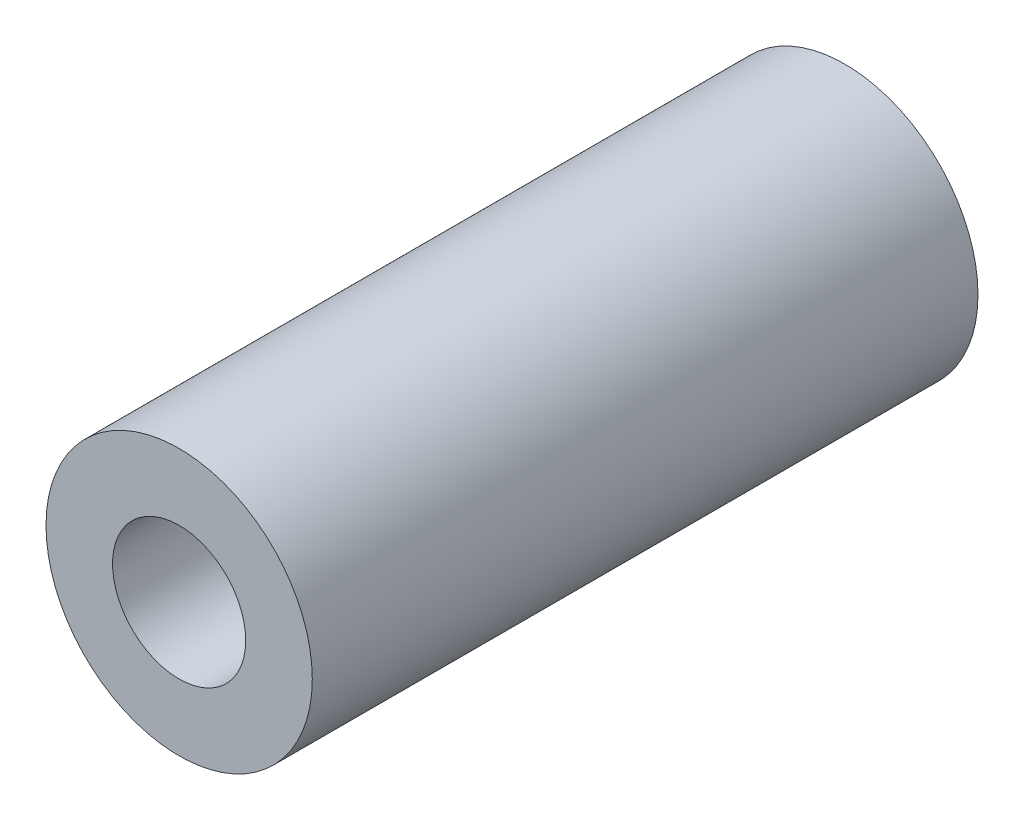
ISO-10303-21;
HEADER;
FILE_DESCRIPTION(('STEP AP214'),'2;1');
FILE_NAME('part.step','',(''),(''),'','','');
FILE_SCHEMA(('AUTOMOTIVE_DESIGN { 1 0 10303 214 1 1 1 1 }'));
ENDSEC;
DATA;
#1=APPLICATION_CONTEXT('core data for automotive mechanical design processes');
#2=APPLICATION_PROTOCOL_DEFINITION('international standard','automotive_design',2000,#1);
#3=PRODUCT_CONTEXT('',#1,'mechanical');
#4=PRODUCT('Part','Part','',(#3));
#5=PRODUCT_RELATED_PRODUCT_CATEGORY('part','',(#4));
#6=PRODUCT_DEFINITION_FORMATION('','',#4);
#7=PRODUCT_DEFINITION_CONTEXT('part definition',#1,'design');
#8=PRODUCT_DEFINITION('design','',#6,#7);
#9=PRODUCT_DEFINITION_SHAPE('','',#8);
#10=(LENGTH_UNIT() NAMED_UNIT(*) SI_UNIT(.MILLI.,.METRE.));
#11=(NAMED_UNIT(*) PLANE_ANGLE_UNIT() SI_UNIT($,.RADIAN.));
#12=(NAMED_UNIT(*) SI_UNIT($,.STERADIAN.) SOLID_ANGLE_UNIT());
#13=UNCERTAINTY_MEASURE_WITH_UNIT(LENGTH_MEASURE(1.E-05),#10,'distance_accuracy_value','');
#14=(GEOMETRIC_REPRESENTATION_CONTEXT(3) GLOBAL_UNCERTAINTY_ASSIGNED_CONTEXT((#13)) GLOBAL_UNIT_ASSIGNED_CONTEXT((#10,
#11,#12)) REPRESENTATION_CONTEXT('',''));
#15=CARTESIAN_POINT('',(0.,0.,0.));
#16=DIRECTION('',(0.,0.,1.));
#17=DIRECTION('',(1.,0.,0.));
#18=AXIS2_PLACEMENT_3D('',#15,#16,#17);
#19=CARTESIAN_POINT('',(0.,0.,7.5));
#20=DIRECTION('',(0.,0.,1.));
#21=DIRECTION('',(1.,0.,0.));
#22=AXIS2_PLACEMENT_3D('',#19,#20,#21);
#23=PLANE('',#22);
#24=CARTESIAN_POINT('',(0.,0.,7.5));
#25=DIRECTION('',(0.,0.,1.));
#26=DIRECTION('',(1.,0.,0.));
#27=AXIS2_PLACEMENT_3D('',#24,#25,#26);
#28=CIRCLE('',#27,3.);
#29=CARTESIAN_POINT('',(3.,0.,7.5));
#30=VERTEX_POINT('',#29);
#31=EDGE_CURVE('E10',#30,#30,#28,.T.);
#32=ORIENTED_EDGE('',*,*,#31,.T.);
#33=EDGE_LOOP('',(#32));
#34=FACE_BOUND('',#33,.T.);
#35=CARTESIAN_POINT('',(0.,0.,7.5));
#36=DIRECTION('',(0.,0.,1.));
#37=DIRECTION('',(1.,0.,0.));
#38=AXIS2_PLACEMENT_3D('',#35,#36,#37);
#39=CIRCLE('',#38,1.5);
#40=CARTESIAN_POINT('',(1.5,0.,7.5));
#41=VERTEX_POINT('',#40);
#42=EDGE_CURVE('E42',#41,#41,#39,.T.);
#43=ORIENTED_EDGE('',*,*,#42,.F.);
#44=EDGE_LOOP('',(#43));
#45=FACE_BOUND('',#44,.T.);
#46=ADVANCED_FACE('F31',(#34,#45),#23,.T.);
#47=CARTESIAN_POINT('',(0.,0.,-7.5));
#48=DIRECTION('',(0.,0.,1.));
#49=DIRECTION('',(1.,0.,0.));
#50=AXIS2_PLACEMENT_3D('',#47,#48,#49);
#51=PLANE('',#50);
#52=CARTESIAN_POINT('',(0.,0.,-7.5));
#53=DIRECTION('',(0.,0.,1.));
#54=DIRECTION('',(1.,0.,0.));
#55=AXIS2_PLACEMENT_3D('',#52,#53,#54);
#56=CIRCLE('',#55,3.);
#57=CARTESIAN_POINT('',(3.,0.,-7.5));
#58=VERTEX_POINT('',#57);
#59=EDGE_CURVE('E35',#58,#58,#56,.T.);
#60=ORIENTED_EDGE('',*,*,#59,.F.);
#61=EDGE_LOOP('',(#60));
#62=FACE_BOUND('',#61,.T.);
#63=CARTESIAN_POINT('',(0.,0.,-7.5));
#64=DIRECTION('',(0.,0.,1.));
#65=DIRECTION('',(1.,0.,0.));
#66=AXIS2_PLACEMENT_3D('',#63,#64,#65);
#67=CIRCLE('',#66,1.5);
#68=CARTESIAN_POINT('',(1.5,0.,-7.5));
#69=VERTEX_POINT('',#68);
#70=EDGE_CURVE('E44',#69,#69,#67,.T.);
#71=ORIENTED_EDGE('',*,*,#70,.T.);
#72=EDGE_LOOP('',(#71));
#73=FACE_BOUND('',#72,.T.);
#74=ADVANCED_FACE('F54',(#62,#73),#51,.F.);
#75=CARTESIAN_POINT('',(0.,0.,7.5));
#76=DIRECTION('',(0.,0.,-1.));
#77=DIRECTION('',(-1.,0.,0.));
#78=AXIS2_PLACEMENT_3D('',#75,#76,#77);
#79=CYLINDRICAL_SURFACE('',#78,3.);
#80=ORIENTED_EDGE('',*,*,#31,.F.);
#81=EDGE_LOOP('',(#80));
#82=FACE_BOUND('',#81,.T.);
#83=ORIENTED_EDGE('',*,*,#59,.T.);
#84=EDGE_LOOP('',(#83));
#85=FACE_BOUND('',#84,.T.);
#86=ADVANCED_FACE('F33',(#82,#85),#79,.T.);
#87=CARTESIAN_POINT('',(0.,0.,7.5));
#88=DIRECTION('',(0.,0.,-1.));
#89=DIRECTION('',(-1.,0.,0.));
#90=AXIS2_PLACEMENT_3D('',#87,#88,#89);
#91=CYLINDRICAL_SURFACE('',#90,1.5);
#92=ORIENTED_EDGE('',*,*,#42,.T.);
#93=EDGE_LOOP('',(#92));
#94=FACE_BOUND('',#93,.T.);
#95=ORIENTED_EDGE('',*,*,#70,.F.);
#96=EDGE_LOOP('',(#95));
#97=FACE_BOUND('',#96,.T.);
#98=ADVANCED_FACE('F50',(#94,#97),#91,.F.);
#99=CLOSED_SHELL('',(#46,#74,#86,#98));
#100=MANIFOLD_SOLID_BREP('B2',#99);
#101=ADVANCED_BREP_SHAPE_REPRESENTATION('',(#18,#100),#14);
#102=SHAPE_DEFINITION_REPRESENTATION(#9,#101);
ENDSEC;
END-ISO-10303-21;
